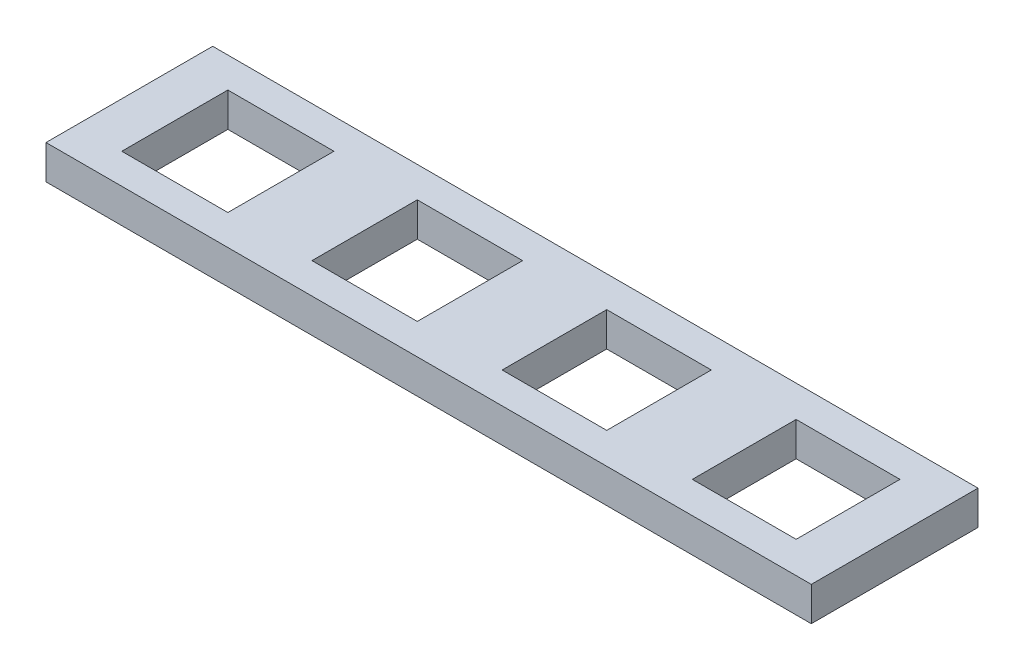
ISO-10303-21;
HEADER;
FILE_DESCRIPTION(('STEP AP214'),'2;1');
FILE_NAME('part.step','',(''),(''),'','','');
FILE_SCHEMA(('AUTOMOTIVE_DESIGN { 1 0 10303 214 1 1 1 1 }'));
ENDSEC;
DATA;
#1=APPLICATION_CONTEXT('core data for automotive mechanical design processes');
#2=APPLICATION_PROTOCOL_DEFINITION('international standard','automotive_design',2000,#1);
#3=PRODUCT_CONTEXT('',#1,'mechanical');
#4=PRODUCT('Part','Part','',(#3));
#5=PRODUCT_RELATED_PRODUCT_CATEGORY('part','',(#4));
#6=PRODUCT_DEFINITION_FORMATION('','',#4);
#7=PRODUCT_DEFINITION_CONTEXT('part definition',#1,'design');
#8=PRODUCT_DEFINITION('design','',#6,#7);
#9=PRODUCT_DEFINITION_SHAPE('','',#8);
#10=(LENGTH_UNIT() NAMED_UNIT(*) SI_UNIT(.MILLI.,.METRE.));
#11=(NAMED_UNIT(*) PLANE_ANGLE_UNIT() SI_UNIT($,.RADIAN.));
#12=(NAMED_UNIT(*) SI_UNIT($,.STERADIAN.) SOLID_ANGLE_UNIT());
#13=UNCERTAINTY_MEASURE_WITH_UNIT(LENGTH_MEASURE(1.E-05),#10,'distance_accuracy_value','');
#14=(GEOMETRIC_REPRESENTATION_CONTEXT(3) GLOBAL_UNCERTAINTY_ASSIGNED_CONTEXT((#13)) GLOBAL_UNIT_ASSIGNED_CONTEXT((#10,
#11,#12)) REPRESENTATION_CONTEXT('',''));
#15=CARTESIAN_POINT('',(0.,0.,0.));
#16=DIRECTION('',(0.,0.,1.));
#17=DIRECTION('',(1.,0.,0.));
#18=AXIS2_PLACEMENT_3D('',#15,#16,#17);
#19=CARTESIAN_POINT('',(0.,4.5,0.));
#20=DIRECTION('',(0.,-1.,0.));
#21=DIRECTION('',(0.,0.,-1.));
#22=AXIS2_PLACEMENT_3D('',#19,#20,#21);
#23=PLANE('',#22);
#24=DIRECTION('',(0.,0.,-1.));
#25=VECTOR('',#24,1.);
#26=CARTESIAN_POINT('',(69.9,4.5,-4.1));
#27=LINE('',#26,#25);
#28=CARTESIAN_POINT('',(69.9,4.5,-4.1));
#29=VERTEX_POINT('',#28);
#30=CARTESIAN_POINT('',(69.9,4.5,-17.9));
#31=VERTEX_POINT('',#30);
#32=EDGE_CURVE('E212',#29,#31,#27,.T.);
#33=ORIENTED_EDGE('',*,*,#32,.F.);
#34=DIRECTION('',(1.,0.,0.));
#35=VECTOR('',#34,1.);
#36=CARTESIAN_POINT('',(56.1,4.5,-4.1));
#37=LINE('',#36,#35);
#38=CARTESIAN_POINT('',(56.1,4.5,-4.1));
#39=VERTEX_POINT('',#38);
#40=EDGE_CURVE('E220',#39,#29,#37,.T.);
#41=ORIENTED_EDGE('',*,*,#40,.F.);
#42=DIRECTION('',(0.,0.,1.));
#43=VECTOR('',#42,1.);
#44=CARTESIAN_POINT('',(56.1,4.5,-4.1));
#45=LINE('',#44,#43);
#46=CARTESIAN_POINT('',(56.1,4.5,-17.9));
#47=VERTEX_POINT('',#46);
#48=EDGE_CURVE('E217',#47,#39,#45,.T.);
#49=ORIENTED_EDGE('',*,*,#48,.F.);
#50=DIRECTION('',(-1.,0.,0.));
#51=VECTOR('',#50,1.);
#52=CARTESIAN_POINT('',(56.1,4.5,-17.9));
#53=LINE('',#52,#51);
#54=EDGE_CURVE('E214',#31,#47,#53,.T.);
#55=ORIENTED_EDGE('',*,*,#54,.F.);
#56=EDGE_LOOP('',(#33,#41,#49,#55));
#57=FACE_BOUND('',#56,.T.);
#58=DIRECTION('',(0.,0.,1.));
#59=VECTOR('',#58,1.);
#60=CARTESIAN_POINT('',(6.,4.5,-18.));
#61=LINE('',#60,#59);
#62=CARTESIAN_POINT('',(6.,4.5,-18.));
#63=VERTEX_POINT('',#62);
#64=CARTESIAN_POINT('',(6.,4.5,-4.));
#65=VERTEX_POINT('',#64);
#66=EDGE_CURVE('E274',#63,#65,#61,.T.);
#67=ORIENTED_EDGE('',*,*,#66,.F.);
#68=DIRECTION('',(-1.,0.,0.));
#69=VECTOR('',#68,1.);
#70=CARTESIAN_POINT('',(6.,4.5,-18.));
#71=LINE('',#70,#69);
#72=CARTESIAN_POINT('',(20.,4.5,-18.));
#73=VERTEX_POINT('',#72);
#74=EDGE_CURVE('E282',#73,#63,#71,.T.);
#75=ORIENTED_EDGE('',*,*,#74,.F.);
#76=DIRECTION('',(0.,0.,-1.));
#77=VECTOR('',#76,1.);
#78=CARTESIAN_POINT('',(20.,4.5,-18.));
#79=LINE('',#78,#77);
#80=CARTESIAN_POINT('',(20.,4.5,-4.));
#81=VERTEX_POINT('',#80);
#82=EDGE_CURVE('E279',#81,#73,#79,.T.);
#83=ORIENTED_EDGE('',*,*,#82,.F.);
#84=DIRECTION('',(1.,0.,0.));
#85=VECTOR('',#84,1.);
#86=CARTESIAN_POINT('',(6.,4.5,-4.));
#87=LINE('',#86,#85);
#88=EDGE_CURVE('E276',#65,#81,#87,.T.);
#89=ORIENTED_EDGE('',*,*,#88,.F.);
#90=EDGE_LOOP('',(#67,#75,#83,#89));
#91=FACE_BOUND('',#90,.T.);
#92=DIRECTION('',(0.,0.,1.));
#93=VECTOR('',#92,1.);
#94=CARTESIAN_POINT('',(0.,4.5,0.));
#95=LINE('',#94,#93);
#96=CARTESIAN_POINT('',(0.,4.5,-22.));
#97=VERTEX_POINT('',#96);
#98=CARTESIAN_POINT('',(0.,4.5,0.));
#99=VERTEX_POINT('',#98);
#100=EDGE_CURVE('E305',#97,#99,#95,.T.);
#101=ORIENTED_EDGE('',*,*,#100,.T.);
#102=DIRECTION('',(1.,0.,0.));
#103=VECTOR('',#102,1.);
#104=CARTESIAN_POINT('',(0.,4.5,0.));
#105=LINE('',#104,#103);
#106=CARTESIAN_POINT('',(101.,4.5,0.));
#107=VERTEX_POINT('',#106);
#108=EDGE_CURVE('E308',#99,#107,#105,.T.);
#109=ORIENTED_EDGE('',*,*,#108,.T.);
#110=DIRECTION('',(0.,0.,-1.));
#111=VECTOR('',#110,1.);
#112=CARTESIAN_POINT('',(101.,4.5,0.));
#113=LINE('',#112,#111);
#114=CARTESIAN_POINT('',(101.,4.5,-22.));
#115=VERTEX_POINT('',#114);
#116=EDGE_CURVE('E311',#107,#115,#113,.T.);
#117=ORIENTED_EDGE('',*,*,#116,.T.);
#118=DIRECTION('',(-1.,0.,0.));
#119=VECTOR('',#118,1.);
#120=CARTESIAN_POINT('',(0.,4.5,-22.));
#121=LINE('',#120,#119);
#122=EDGE_CURVE('E313',#115,#97,#121,.T.);
#123=ORIENTED_EDGE('',*,*,#122,.T.);
#124=EDGE_LOOP('',(#101,#109,#117,#123));
#125=FACE_BOUND('',#124,.T.);
#126=DIRECTION('',(0.,0.,-1.));
#127=VECTOR('',#126,1.);
#128=CARTESIAN_POINT('',(44.95,4.5,-4.05));
#129=LINE('',#128,#127);
#130=CARTESIAN_POINT('',(44.95,4.5,-4.05));
#131=VERTEX_POINT('',#130);
#132=CARTESIAN_POINT('',(44.95,4.5,-17.95));
#133=VERTEX_POINT('',#132);
#134=EDGE_CURVE('E243',#131,#133,#129,.T.);
#135=ORIENTED_EDGE('',*,*,#134,.F.);
#136=DIRECTION('',(1.,0.,0.));
#137=VECTOR('',#136,1.);
#138=CARTESIAN_POINT('',(31.05,4.5,-4.05));
#139=LINE('',#138,#137);
#140=CARTESIAN_POINT('',(31.05,4.5,-4.05));
#141=VERTEX_POINT('',#140);
#142=EDGE_CURVE('E251',#141,#131,#139,.T.);
#143=ORIENTED_EDGE('',*,*,#142,.F.);
#144=DIRECTION('',(0.,0.,1.));
#145=VECTOR('',#144,1.);
#146=CARTESIAN_POINT('',(31.05,4.5,-4.05));
#147=LINE('',#146,#145);
#148=CARTESIAN_POINT('',(31.05,4.5,-17.95));
#149=VERTEX_POINT('',#148);
#150=EDGE_CURVE('E248',#149,#141,#147,.T.);
#151=ORIENTED_EDGE('',*,*,#150,.F.);
#152=DIRECTION('',(-1.,0.,0.));
#153=VECTOR('',#152,1.);
#154=CARTESIAN_POINT('',(31.05,4.5,-17.95));
#155=LINE('',#154,#153);
#156=EDGE_CURVE('E245',#133,#149,#155,.T.);
#157=ORIENTED_EDGE('',*,*,#156,.F.);
#158=EDGE_LOOP('',(#135,#143,#151,#157));
#159=FACE_BOUND('',#158,.T.);
#160=DIRECTION('',(0.,0.,-1.));
#161=VECTOR('',#160,1.);
#162=CARTESIAN_POINT('',(94.85,4.5,-4.15));
#163=LINE('',#162,#161);
#164=CARTESIAN_POINT('',(94.85,4.5,-4.15));
#165=VERTEX_POINT('',#164);
#166=CARTESIAN_POINT('',(94.85,4.5,-17.85));
#167=VERTEX_POINT('',#166);
#168=EDGE_CURVE('E176',#165,#167,#163,.T.);
#169=ORIENTED_EDGE('',*,*,#168,.F.);
#170=DIRECTION('',(1.,0.,0.));
#171=VECTOR('',#170,1.);
#172=CARTESIAN_POINT('',(81.15,4.5,-4.15));
#173=LINE('',#172,#171);
#174=CARTESIAN_POINT('',(81.15,4.5,-4.15));
#175=VERTEX_POINT('',#174);
#176=EDGE_CURVE('E198',#175,#165,#173,.T.);
#177=ORIENTED_EDGE('',*,*,#176,.F.);
#178=DIRECTION('',(0.,0.,1.));
#179=VECTOR('',#178,1.);
#180=CARTESIAN_POINT('',(81.15,4.5,-4.15));
#181=LINE('',#180,#179);
#182=CARTESIAN_POINT('',(81.15,4.5,-17.85));
#183=VERTEX_POINT('',#182);
#184=EDGE_CURVE('E196',#183,#175,#181,.T.);
#185=ORIENTED_EDGE('',*,*,#184,.F.);
#186=DIRECTION('',(-1.,0.,0.));
#187=VECTOR('',#186,1.);
#188=CARTESIAN_POINT('',(81.15,4.5,-17.85));
#189=LINE('',#188,#187);
#190=EDGE_CURVE('E184',#167,#183,#189,.T.);
#191=ORIENTED_EDGE('',*,*,#190,.F.);
#192=EDGE_LOOP('',(#169,#177,#185,#191));
#193=FACE_BOUND('',#192,.T.);
#194=ADVANCED_FACE('F39',(#57,#91,#125,#159,#193),#23,.F.);
#195=CARTESIAN_POINT('',(0.,0.,0.));
#196=DIRECTION('',(0.,-1.,0.));
#197=DIRECTION('',(0.,0.,-1.));
#198=AXIS2_PLACEMENT_3D('',#195,#196,#197);
#199=PLANE('',#198);
#200=DIRECTION('',(0.,0.,1.));
#201=VECTOR('',#200,1.);
#202=CARTESIAN_POINT('',(0.,0.,0.));
#203=LINE('',#202,#201);
#204=CARTESIAN_POINT('',(0.,0.,-22.));
#205=VERTEX_POINT('',#204);
#206=CARTESIAN_POINT('',(0.,0.,0.));
#207=VERTEX_POINT('',#206);
#208=EDGE_CURVE('E304',#205,#207,#203,.T.);
#209=ORIENTED_EDGE('',*,*,#208,.F.);
#210=DIRECTION('',(-1.,0.,0.));
#211=VECTOR('',#210,1.);
#212=CARTESIAN_POINT('',(0.,0.,-22.));
#213=LINE('',#212,#211);
#214=CARTESIAN_POINT('',(101.,0.,-22.));
#215=VERTEX_POINT('',#214);
#216=EDGE_CURVE('E309',#215,#205,#213,.T.);
#217=ORIENTED_EDGE('',*,*,#216,.F.);
#218=DIRECTION('',(0.,0.,-1.));
#219=VECTOR('',#218,1.);
#220=CARTESIAN_POINT('',(101.,0.,0.));
#221=LINE('',#220,#219);
#222=CARTESIAN_POINT('',(101.,0.,0.));
#223=VERTEX_POINT('',#222);
#224=EDGE_CURVE('E320',#223,#215,#221,.T.);
#225=ORIENTED_EDGE('',*,*,#224,.F.);
#226=DIRECTION('',(1.,0.,0.));
#227=VECTOR('',#226,1.);
#228=CARTESIAN_POINT('',(0.,0.,0.));
#229=LINE('',#228,#227);
#230=EDGE_CURVE('E318',#207,#223,#229,.T.);
#231=ORIENTED_EDGE('',*,*,#230,.F.);
#232=EDGE_LOOP('',(#209,#217,#225,#231));
#233=FACE_BOUND('',#232,.T.);
#234=DIRECTION('',(-1.,0.,0.));
#235=VECTOR('',#234,1.);
#236=CARTESIAN_POINT('',(6.,0.,-18.));
#237=LINE('',#236,#235);
#238=CARTESIAN_POINT('',(20.,0.,-18.));
#239=VERTEX_POINT('',#238);
#240=CARTESIAN_POINT('',(6.,0.,-18.));
#241=VERTEX_POINT('',#240);
#242=EDGE_CURVE('E277',#239,#241,#237,.T.);
#243=ORIENTED_EDGE('',*,*,#242,.T.);
#244=DIRECTION('',(0.,0.,1.));
#245=VECTOR('',#244,1.);
#246=CARTESIAN_POINT('',(6.,0.,-18.));
#247=LINE('',#246,#245);
#248=CARTESIAN_POINT('',(6.,0.,-4.));
#249=VERTEX_POINT('',#248);
#250=EDGE_CURVE('E273',#241,#249,#247,.T.);
#251=ORIENTED_EDGE('',*,*,#250,.T.);
#252=DIRECTION('',(1.,0.,0.));
#253=VECTOR('',#252,1.);
#254=CARTESIAN_POINT('',(6.,0.,-4.));
#255=LINE('',#254,#253);
#256=CARTESIAN_POINT('',(20.,0.,-4.));
#257=VERTEX_POINT('',#256);
#258=EDGE_CURVE('E287',#249,#257,#255,.T.);
#259=ORIENTED_EDGE('',*,*,#258,.T.);
#260=DIRECTION('',(0.,0.,-1.));
#261=VECTOR('',#260,1.);
#262=CARTESIAN_POINT('',(20.,0.,-18.));
#263=LINE('',#262,#261);
#264=EDGE_CURVE('E290',#257,#239,#263,.T.);
#265=ORIENTED_EDGE('',*,*,#264,.T.);
#266=EDGE_LOOP('',(#243,#251,#259,#265));
#267=FACE_BOUND('',#266,.T.);
#268=DIRECTION('',(1.,0.,0.));
#269=VECTOR('',#268,1.);
#270=CARTESIAN_POINT('',(31.05,0.,-4.05));
#271=LINE('',#270,#269);
#272=CARTESIAN_POINT('',(31.05,0.,-4.05));
#273=VERTEX_POINT('',#272);
#274=CARTESIAN_POINT('',(44.95,0.,-4.05));
#275=VERTEX_POINT('',#274);
#276=EDGE_CURVE('E246',#273,#275,#271,.T.);
#277=ORIENTED_EDGE('',*,*,#276,.T.);
#278=DIRECTION('',(0.,0.,-1.));
#279=VECTOR('',#278,1.);
#280=CARTESIAN_POINT('',(44.95,0.,-4.05));
#281=LINE('',#280,#279);
#282=CARTESIAN_POINT('',(44.95,0.,-17.95));
#283=VERTEX_POINT('',#282);
#284=EDGE_CURVE('E242',#275,#283,#281,.T.);
#285=ORIENTED_EDGE('',*,*,#284,.T.);
#286=DIRECTION('',(-1.,0.,0.));
#287=VECTOR('',#286,1.);
#288=CARTESIAN_POINT('',(31.05,0.,-17.95));
#289=LINE('',#288,#287);
#290=CARTESIAN_POINT('',(31.05,0.,-17.95));
#291=VERTEX_POINT('',#290);
#292=EDGE_CURVE('E256',#283,#291,#289,.T.);
#293=ORIENTED_EDGE('',*,*,#292,.T.);
#294=DIRECTION('',(0.,0.,1.));
#295=VECTOR('',#294,1.);
#296=CARTESIAN_POINT('',(31.05,0.,-4.05));
#297=LINE('',#296,#295);
#298=EDGE_CURVE('E259',#291,#273,#297,.T.);
#299=ORIENTED_EDGE('',*,*,#298,.T.);
#300=EDGE_LOOP('',(#277,#285,#293,#299));
#301=FACE_BOUND('',#300,.T.);
#302=DIRECTION('',(1.,0.,0.));
#303=VECTOR('',#302,1.);
#304=CARTESIAN_POINT('',(56.1,0.,-4.1));
#305=LINE('',#304,#303);
#306=CARTESIAN_POINT('',(56.1,0.,-4.1));
#307=VERTEX_POINT('',#306);
#308=CARTESIAN_POINT('',(69.9,0.,-4.1));
#309=VERTEX_POINT('',#308);
#310=EDGE_CURVE('E215',#307,#309,#305,.T.);
#311=ORIENTED_EDGE('',*,*,#310,.T.);
#312=DIRECTION('',(0.,0.,-1.));
#313=VECTOR('',#312,1.);
#314=CARTESIAN_POINT('',(69.9,0.,-4.1));
#315=LINE('',#314,#313);
#316=CARTESIAN_POINT('',(69.9,0.,-17.9));
#317=VERTEX_POINT('',#316);
#318=EDGE_CURVE('E192',#309,#317,#315,.T.);
#319=ORIENTED_EDGE('',*,*,#318,.T.);
#320=DIRECTION('',(-1.,0.,0.));
#321=VECTOR('',#320,1.);
#322=CARTESIAN_POINT('',(56.1,0.,-17.9));
#323=LINE('',#322,#321);
#324=CARTESIAN_POINT('',(56.1,0.,-17.9));
#325=VERTEX_POINT('',#324);
#326=EDGE_CURVE('E225',#317,#325,#323,.T.);
#327=ORIENTED_EDGE('',*,*,#326,.T.);
#328=DIRECTION('',(0.,0.,1.));
#329=VECTOR('',#328,1.);
#330=CARTESIAN_POINT('',(56.1,0.,-4.1));
#331=LINE('',#330,#329);
#332=EDGE_CURVE('E228',#325,#307,#331,.T.);
#333=ORIENTED_EDGE('',*,*,#332,.T.);
#334=EDGE_LOOP('',(#311,#319,#327,#333));
#335=FACE_BOUND('',#334,.T.);
#336=DIRECTION('',(1.,0.,0.));
#337=VECTOR('',#336,1.);
#338=CARTESIAN_POINT('',(81.15,0.,-4.15));
#339=LINE('',#338,#337);
#340=CARTESIAN_POINT('',(81.15,0.,-4.15));
#341=VERTEX_POINT('',#340);
#342=CARTESIAN_POINT('',(94.85,0.,-4.15));
#343=VERTEX_POINT('',#342);
#344=EDGE_CURVE('E185',#341,#343,#339,.T.);
#345=ORIENTED_EDGE('',*,*,#344,.T.);
#346=DIRECTION('',(0.,0.,-1.));
#347=VECTOR('',#346,1.);
#348=CARTESIAN_POINT('',(94.85,0.,-4.15));
#349=LINE('',#348,#347);
#350=CARTESIAN_POINT('',(94.85,0.,-17.85));
#351=VERTEX_POINT('',#350);
#352=EDGE_CURVE('E62',#343,#351,#349,.T.);
#353=ORIENTED_EDGE('',*,*,#352,.T.);
#354=DIRECTION('',(-1.,0.,0.));
#355=VECTOR('',#354,1.);
#356=CARTESIAN_POINT('',(81.15,0.,-17.85));
#357=LINE('',#356,#355);
#358=CARTESIAN_POINT('',(81.15,0.,-17.85));
#359=VERTEX_POINT('',#358);
#360=EDGE_CURVE('E191',#351,#359,#357,.T.);
#361=ORIENTED_EDGE('',*,*,#360,.T.);
#362=DIRECTION('',(0.,0.,1.));
#363=VECTOR('',#362,1.);
#364=CARTESIAN_POINT('',(81.15,0.,-4.15));
#365=LINE('',#364,#363);
#366=EDGE_CURVE('E204',#359,#341,#365,.T.);
#367=ORIENTED_EDGE('',*,*,#366,.T.);
#368=EDGE_LOOP('',(#345,#353,#361,#367));
#369=FACE_BOUND('',#368,.T.);
#370=ADVANCED_FACE('F338',(#233,#267,#301,#335,#369),#199,.T.);
#371=CARTESIAN_POINT('',(0.,4.5,0.));
#372=DIRECTION('',(1.,0.,0.));
#373=DIRECTION('',(0.,0.,-1.));
#374=AXIS2_PLACEMENT_3D('',#371,#372,#373);
#375=PLANE('',#374);
#376=ORIENTED_EDGE('',*,*,#208,.T.);
#377=DIRECTION('',(0.,-1.,0.));
#378=VECTOR('',#377,1.);
#379=CARTESIAN_POINT('',(0.,4.5,0.));
#380=LINE('',#379,#378);
#381=EDGE_CURVE('E11',#99,#207,#380,.T.);
#382=ORIENTED_EDGE('',*,*,#381,.F.);
#383=ORIENTED_EDGE('',*,*,#100,.F.);
#384=DIRECTION('',(0.,-1.,0.));
#385=VECTOR('',#384,1.);
#386=CARTESIAN_POINT('',(0.,4.5,-22.));
#387=LINE('',#386,#385);
#388=EDGE_CURVE('E315',#97,#205,#387,.T.);
#389=ORIENTED_EDGE('',*,*,#388,.T.);
#390=EDGE_LOOP('',(#376,#382,#383,#389));
#391=FACE_BOUND('',#390,.T.);
#392=ADVANCED_FACE('F41',(#391),#375,.F.);
#393=CARTESIAN_POINT('',(0.,4.5,0.));
#394=DIRECTION('',(0.,0.,-1.));
#395=DIRECTION('',(-1.,0.,0.));
#396=AXIS2_PLACEMENT_3D('',#393,#394,#395);
#397=PLANE('',#396);
#398=ORIENTED_EDGE('',*,*,#230,.T.);
#399=DIRECTION('',(0.,-1.,0.));
#400=VECTOR('',#399,1.);
#401=CARTESIAN_POINT('',(101.,4.5,0.));
#402=LINE('',#401,#400);
#403=EDGE_CURVE('E47',#107,#223,#402,.T.);
#404=ORIENTED_EDGE('',*,*,#403,.F.);
#405=ORIENTED_EDGE('',*,*,#108,.F.);
#406=ORIENTED_EDGE('',*,*,#381,.T.);
#407=EDGE_LOOP('',(#398,#404,#405,#406));
#408=FACE_BOUND('',#407,.T.);
#409=ADVANCED_FACE('F349',(#408),#397,.F.);
#410=CARTESIAN_POINT('',(101.,4.5,0.));
#411=DIRECTION('',(-1.,0.,0.));
#412=DIRECTION('',(0.,0.,1.));
#413=AXIS2_PLACEMENT_3D('',#410,#411,#412);
#414=PLANE('',#413);
#415=ORIENTED_EDGE('',*,*,#224,.T.);
#416=DIRECTION('',(0.,-1.,0.));
#417=VECTOR('',#416,1.);
#418=CARTESIAN_POINT('',(101.,4.5,-22.));
#419=LINE('',#418,#417);
#420=EDGE_CURVE('E325',#115,#215,#419,.T.);
#421=ORIENTED_EDGE('',*,*,#420,.F.);
#422=ORIENTED_EDGE('',*,*,#116,.F.);
#423=ORIENTED_EDGE('',*,*,#403,.T.);
#424=EDGE_LOOP('',(#415,#421,#422,#423));
#425=FACE_BOUND('',#424,.T.);
#426=ADVANCED_FACE('F332',(#425),#414,.F.);
#427=CARTESIAN_POINT('',(0.,4.5,-22.));
#428=DIRECTION('',(0.,0.,1.));
#429=DIRECTION('',(1.,0.,0.));
#430=AXIS2_PLACEMENT_3D('',#427,#428,#429);
#431=PLANE('',#430);
#432=ORIENTED_EDGE('',*,*,#216,.T.);
#433=ORIENTED_EDGE('',*,*,#388,.F.);
#434=ORIENTED_EDGE('',*,*,#122,.F.);
#435=ORIENTED_EDGE('',*,*,#420,.T.);
#436=EDGE_LOOP('',(#432,#433,#434,#435));
#437=FACE_BOUND('',#436,.T.);
#438=ADVANCED_FACE('F342',(#437),#431,.F.);
#439=CARTESIAN_POINT('',(6.,4.5,-18.));
#440=DIRECTION('',(1.,0.,0.));
#441=DIRECTION('',(0.,0.,-1.));
#442=AXIS2_PLACEMENT_3D('',#439,#440,#441);
#443=PLANE('',#442);
#444=ORIENTED_EDGE('',*,*,#250,.F.);
#445=DIRECTION('',(0.,-1.,0.));
#446=VECTOR('',#445,1.);
#447=CARTESIAN_POINT('',(6.,4.5,-18.));
#448=LINE('',#447,#446);
#449=EDGE_CURVE('E284',#63,#241,#448,.T.);
#450=ORIENTED_EDGE('',*,*,#449,.F.);
#451=ORIENTED_EDGE('',*,*,#66,.T.);
#452=DIRECTION('',(0.,-1.,0.));
#453=VECTOR('',#452,1.);
#454=CARTESIAN_POINT('',(6.,4.5,-4.));
#455=LINE('',#454,#453);
#456=EDGE_CURVE('E301',#65,#249,#455,.T.);
#457=ORIENTED_EDGE('',*,*,#456,.T.);
#458=EDGE_LOOP('',(#444,#450,#451,#457));
#459=FACE_BOUND('',#458,.T.);
#460=ADVANCED_FACE('F366',(#459),#443,.T.);
#461=CARTESIAN_POINT('',(6.,4.5,-4.));
#462=DIRECTION('',(0.,0.,-1.));
#463=DIRECTION('',(-1.,0.,0.));
#464=AXIS2_PLACEMENT_3D('',#461,#462,#463);
#465=PLANE('',#464);
#466=ORIENTED_EDGE('',*,*,#258,.F.);
#467=ORIENTED_EDGE('',*,*,#456,.F.);
#468=ORIENTED_EDGE('',*,*,#88,.T.);
#469=DIRECTION('',(0.,-1.,0.));
#470=VECTOR('',#469,1.);
#471=CARTESIAN_POINT('',(20.,4.5,-4.));
#472=LINE('',#471,#470);
#473=EDGE_CURVE('E299',#81,#257,#472,.T.);
#474=ORIENTED_EDGE('',*,*,#473,.T.);
#475=EDGE_LOOP('',(#466,#467,#468,#474));
#476=FACE_BOUND('',#475,.T.);
#477=ADVANCED_FACE('F373',(#476),#465,.T.);
#478=CARTESIAN_POINT('',(20.,4.5,-18.));
#479=DIRECTION('',(-1.,0.,0.));
#480=DIRECTION('',(0.,0.,1.));
#481=AXIS2_PLACEMENT_3D('',#478,#479,#480);
#482=PLANE('',#481);
#483=ORIENTED_EDGE('',*,*,#264,.F.);
#484=ORIENTED_EDGE('',*,*,#473,.F.);
#485=ORIENTED_EDGE('',*,*,#82,.T.);
#486=DIRECTION('',(0.,-1.,0.));
#487=VECTOR('',#486,1.);
#488=CARTESIAN_POINT('',(20.,4.5,-18.));
#489=LINE('',#488,#487);
#490=EDGE_CURVE('E297',#73,#239,#489,.T.);
#491=ORIENTED_EDGE('',*,*,#490,.T.);
#492=EDGE_LOOP('',(#483,#484,#485,#491));
#493=FACE_BOUND('',#492,.T.);
#494=ADVANCED_FACE('F378',(#493),#482,.T.);
#495=CARTESIAN_POINT('',(6.,4.5,-18.));
#496=DIRECTION('',(0.,0.,1.));
#497=DIRECTION('',(1.,0.,0.));
#498=AXIS2_PLACEMENT_3D('',#495,#496,#497);
#499=PLANE('',#498);
#500=ORIENTED_EDGE('',*,*,#242,.F.);
#501=ORIENTED_EDGE('',*,*,#490,.F.);
#502=ORIENTED_EDGE('',*,*,#74,.T.);
#503=ORIENTED_EDGE('',*,*,#449,.T.);
#504=EDGE_LOOP('',(#500,#501,#502,#503));
#505=FACE_BOUND('',#504,.T.);
#506=ADVANCED_FACE('F385',(#505),#499,.T.);
#507=CARTESIAN_POINT('',(44.95,4.5,-4.05));
#508=DIRECTION('',(-1.,0.,0.));
#509=DIRECTION('',(0.,0.,1.));
#510=AXIS2_PLACEMENT_3D('',#507,#508,#509);
#511=PLANE('',#510);
#512=ORIENTED_EDGE('',*,*,#284,.F.);
#513=DIRECTION('',(0.,-1.,0.));
#514=VECTOR('',#513,1.);
#515=CARTESIAN_POINT('',(44.95,4.5,-4.05));
#516=LINE('',#515,#514);
#517=EDGE_CURVE('E253',#131,#275,#516,.T.);
#518=ORIENTED_EDGE('',*,*,#517,.F.);
#519=ORIENTED_EDGE('',*,*,#134,.T.);
#520=DIRECTION('',(0.,-1.,0.));
#521=VECTOR('',#520,1.);
#522=CARTESIAN_POINT('',(44.95,4.5,-17.95));
#523=LINE('',#522,#521);
#524=EDGE_CURVE('E270',#133,#283,#523,.T.);
#525=ORIENTED_EDGE('',*,*,#524,.T.);
#526=EDGE_LOOP('',(#512,#518,#519,#525));
#527=FACE_BOUND('',#526,.T.);
#528=ADVANCED_FACE('F398',(#527),#511,.T.);
#529=CARTESIAN_POINT('',(31.05,4.5,-17.95));
#530=DIRECTION('',(0.,0.,1.));
#531=DIRECTION('',(1.,0.,0.));
#532=AXIS2_PLACEMENT_3D('',#529,#530,#531);
#533=PLANE('',#532);
#534=ORIENTED_EDGE('',*,*,#292,.F.);
#535=ORIENTED_EDGE('',*,*,#524,.F.);
#536=ORIENTED_EDGE('',*,*,#156,.T.);
#537=DIRECTION('',(0.,-1.,0.));
#538=VECTOR('',#537,1.);
#539=CARTESIAN_POINT('',(31.05,4.5,-17.95));
#540=LINE('',#539,#538);
#541=EDGE_CURVE('E268',#149,#291,#540,.T.);
#542=ORIENTED_EDGE('',*,*,#541,.T.);
#543=EDGE_LOOP('',(#534,#535,#536,#542));
#544=FACE_BOUND('',#543,.T.);
#545=ADVANCED_FACE('F403',(#544),#533,.T.);
#546=CARTESIAN_POINT('',(31.05,4.5,-4.05));
#547=DIRECTION('',(1.,0.,0.));
#548=DIRECTION('',(0.,0.,-1.));
#549=AXIS2_PLACEMENT_3D('',#546,#547,#548);
#550=PLANE('',#549);
#551=ORIENTED_EDGE('',*,*,#298,.F.);
#552=ORIENTED_EDGE('',*,*,#541,.F.);
#553=ORIENTED_EDGE('',*,*,#150,.T.);
#554=DIRECTION('',(0.,-1.,0.));
#555=VECTOR('',#554,1.);
#556=CARTESIAN_POINT('',(31.05,4.5,-4.05));
#557=LINE('',#556,#555);
#558=EDGE_CURVE('E266',#141,#273,#557,.T.);
#559=ORIENTED_EDGE('',*,*,#558,.T.);
#560=EDGE_LOOP('',(#551,#552,#553,#559));
#561=FACE_BOUND('',#560,.T.);
#562=ADVANCED_FACE('F407',(#561),#550,.T.);
#563=CARTESIAN_POINT('',(31.05,4.5,-4.05));
#564=DIRECTION('',(0.,0.,-1.));
#565=DIRECTION('',(-1.,0.,0.));
#566=AXIS2_PLACEMENT_3D('',#563,#564,#565);
#567=PLANE('',#566);
#568=ORIENTED_EDGE('',*,*,#276,.F.);
#569=ORIENTED_EDGE('',*,*,#558,.F.);
#570=ORIENTED_EDGE('',*,*,#142,.T.);
#571=ORIENTED_EDGE('',*,*,#517,.T.);
#572=EDGE_LOOP('',(#568,#569,#570,#571));
#573=FACE_BOUND('',#572,.T.);
#574=ADVANCED_FACE('F411',(#573),#567,.T.);
#575=CARTESIAN_POINT('',(69.9,4.5,-4.1));
#576=DIRECTION('',(-1.,0.,0.));
#577=DIRECTION('',(0.,0.,1.));
#578=AXIS2_PLACEMENT_3D('',#575,#576,#577);
#579=PLANE('',#578);
#580=ORIENTED_EDGE('',*,*,#318,.F.);
#581=DIRECTION('',(0.,-1.,0.));
#582=VECTOR('',#581,1.);
#583=CARTESIAN_POINT('',(69.9,4.5,-4.1));
#584=LINE('',#583,#582);
#585=EDGE_CURVE('E222',#29,#309,#584,.T.);
#586=ORIENTED_EDGE('',*,*,#585,.F.);
#587=ORIENTED_EDGE('',*,*,#32,.T.);
#588=DIRECTION('',(0.,-1.,0.));
#589=VECTOR('',#588,1.);
#590=CARTESIAN_POINT('',(69.9,4.5,-17.9));
#591=LINE('',#590,#589);
#592=EDGE_CURVE('E239',#31,#317,#591,.T.);
#593=ORIENTED_EDGE('',*,*,#592,.T.);
#594=EDGE_LOOP('',(#580,#586,#587,#593));
#595=FACE_BOUND('',#594,.T.);
#596=ADVANCED_FACE('F415',(#595),#579,.T.);
#597=CARTESIAN_POINT('',(56.1,4.5,-17.9));
#598=DIRECTION('',(0.,0.,1.));
#599=DIRECTION('',(1.,0.,0.));
#600=AXIS2_PLACEMENT_3D('',#597,#598,#599);
#601=PLANE('',#600);
#602=ORIENTED_EDGE('',*,*,#326,.F.);
#603=ORIENTED_EDGE('',*,*,#592,.F.);
#604=ORIENTED_EDGE('',*,*,#54,.T.);
#605=DIRECTION('',(0.,-1.,0.));
#606=VECTOR('',#605,1.);
#607=CARTESIAN_POINT('',(56.1,4.5,-17.9));
#608=LINE('',#607,#606);
#609=EDGE_CURVE('E237',#47,#325,#608,.T.);
#610=ORIENTED_EDGE('',*,*,#609,.T.);
#611=EDGE_LOOP('',(#602,#603,#604,#610));
#612=FACE_BOUND('',#611,.T.);
#613=ADVANCED_FACE('F419',(#612),#601,.T.);
#614=CARTESIAN_POINT('',(56.1,4.5,-4.1));
#615=DIRECTION('',(1.,0.,0.));
#616=DIRECTION('',(0.,0.,-1.));
#617=AXIS2_PLACEMENT_3D('',#614,#615,#616);
#618=PLANE('',#617);
#619=ORIENTED_EDGE('',*,*,#332,.F.);
#620=ORIENTED_EDGE('',*,*,#609,.F.);
#621=ORIENTED_EDGE('',*,*,#48,.T.);
#622=DIRECTION('',(0.,-1.,0.));
#623=VECTOR('',#622,1.);
#624=CARTESIAN_POINT('',(56.1,4.5,-4.1));
#625=LINE('',#624,#623);
#626=EDGE_CURVE('E235',#39,#307,#625,.T.);
#627=ORIENTED_EDGE('',*,*,#626,.T.);
#628=EDGE_LOOP('',(#619,#620,#621,#627));
#629=FACE_BOUND('',#628,.T.);
#630=ADVANCED_FACE('F423',(#629),#618,.T.);
#631=CARTESIAN_POINT('',(56.1,4.5,-4.1));
#632=DIRECTION('',(0.,0.,-1.));
#633=DIRECTION('',(-1.,0.,0.));
#634=AXIS2_PLACEMENT_3D('',#631,#632,#633);
#635=PLANE('',#634);
#636=ORIENTED_EDGE('',*,*,#310,.F.);
#637=ORIENTED_EDGE('',*,*,#626,.F.);
#638=ORIENTED_EDGE('',*,*,#40,.T.);
#639=ORIENTED_EDGE('',*,*,#585,.T.);
#640=EDGE_LOOP('',(#636,#637,#638,#639));
#641=FACE_BOUND('',#640,.T.);
#642=ADVANCED_FACE('F427',(#641),#635,.T.);
#643=CARTESIAN_POINT('',(94.85,4.5,-4.15));
#644=DIRECTION('',(-1.,0.,0.));
#645=DIRECTION('',(0.,0.,1.));
#646=AXIS2_PLACEMENT_3D('',#643,#644,#645);
#647=PLANE('',#646);
#648=ORIENTED_EDGE('',*,*,#352,.F.);
#649=DIRECTION('',(0.,-1.,0.));
#650=VECTOR('',#649,1.);
#651=CARTESIAN_POINT('',(94.85,4.5,-4.15));
#652=LINE('',#651,#650);
#653=EDGE_CURVE('E180',#165,#343,#652,.T.);
#654=ORIENTED_EDGE('',*,*,#653,.F.);
#655=ORIENTED_EDGE('',*,*,#168,.T.);
#656=DIRECTION('',(0.,-1.,0.));
#657=VECTOR('',#656,1.);
#658=CARTESIAN_POINT('',(94.85,4.5,-17.85));
#659=LINE('',#658,#657);
#660=EDGE_CURVE('E179',#167,#351,#659,.T.);
#661=ORIENTED_EDGE('',*,*,#660,.T.);
#662=EDGE_LOOP('',(#648,#654,#655,#661));
#663=FACE_BOUND('',#662,.T.);
#664=ADVANCED_FACE('F178',(#663),#647,.T.);
#665=CARTESIAN_POINT('',(81.15,4.5,-17.85));
#666=DIRECTION('',(0.,0.,1.));
#667=DIRECTION('',(1.,0.,0.));
#668=AXIS2_PLACEMENT_3D('',#665,#666,#667);
#669=PLANE('',#668);
#670=ORIENTED_EDGE('',*,*,#360,.F.);
#671=ORIENTED_EDGE('',*,*,#660,.F.);
#672=ORIENTED_EDGE('',*,*,#190,.T.);
#673=DIRECTION('',(0.,-1.,0.));
#674=VECTOR('',#673,1.);
#675=CARTESIAN_POINT('',(81.15,4.5,-17.85));
#676=LINE('',#675,#674);
#677=EDGE_CURVE('E193',#183,#359,#676,.T.);
#678=ORIENTED_EDGE('',*,*,#677,.T.);
#679=EDGE_LOOP('',(#670,#671,#672,#678));
#680=FACE_BOUND('',#679,.T.);
#681=ADVANCED_FACE('F188',(#680),#669,.T.);
#682=CARTESIAN_POINT('',(81.15,4.5,-4.15));
#683=DIRECTION('',(1.,0.,0.));
#684=DIRECTION('',(0.,0.,-1.));
#685=AXIS2_PLACEMENT_3D('',#682,#683,#684);
#686=PLANE('',#685);
#687=ORIENTED_EDGE('',*,*,#366,.F.);
#688=ORIENTED_EDGE('',*,*,#677,.F.);
#689=ORIENTED_EDGE('',*,*,#184,.T.);
#690=DIRECTION('',(0.,-1.,0.));
#691=VECTOR('',#690,1.);
#692=CARTESIAN_POINT('',(81.15,4.5,-4.15));
#693=LINE('',#692,#691);
#694=EDGE_CURVE('E54',#175,#341,#693,.T.);
#695=ORIENTED_EDGE('',*,*,#694,.T.);
#696=EDGE_LOOP('',(#687,#688,#689,#695));
#697=FACE_BOUND('',#696,.T.);
#698=ADVANCED_FACE('F436',(#697),#686,.T.);
#699=CARTESIAN_POINT('',(81.15,4.5,-4.15));
#700=DIRECTION('',(0.,0.,-1.));
#701=DIRECTION('',(-1.,0.,0.));
#702=AXIS2_PLACEMENT_3D('',#699,#700,#701);
#703=PLANE('',#702);
#704=ORIENTED_EDGE('',*,*,#344,.F.);
#705=ORIENTED_EDGE('',*,*,#694,.F.);
#706=ORIENTED_EDGE('',*,*,#176,.T.);
#707=ORIENTED_EDGE('',*,*,#653,.T.);
#708=EDGE_LOOP('',(#704,#705,#706,#707));
#709=FACE_BOUND('',#708,.T.);
#710=ADVANCED_FACE('F439',(#709),#703,.T.);
#711=CLOSED_SHELL('',(#194,#370,#392,#409,#426,#438,#460,#477,#494,#506,#528,#545,#562,#574,
#596,#613,#630,#642,#664,#681,#698,#710));
#712=MANIFOLD_SOLID_BREP('B2',#711);
#713=ADVANCED_BREP_SHAPE_REPRESENTATION('',(#18,#712),#14);
#714=SHAPE_DEFINITION_REPRESENTATION(#9,#713);
ENDSEC;
END-ISO-10303-21;
